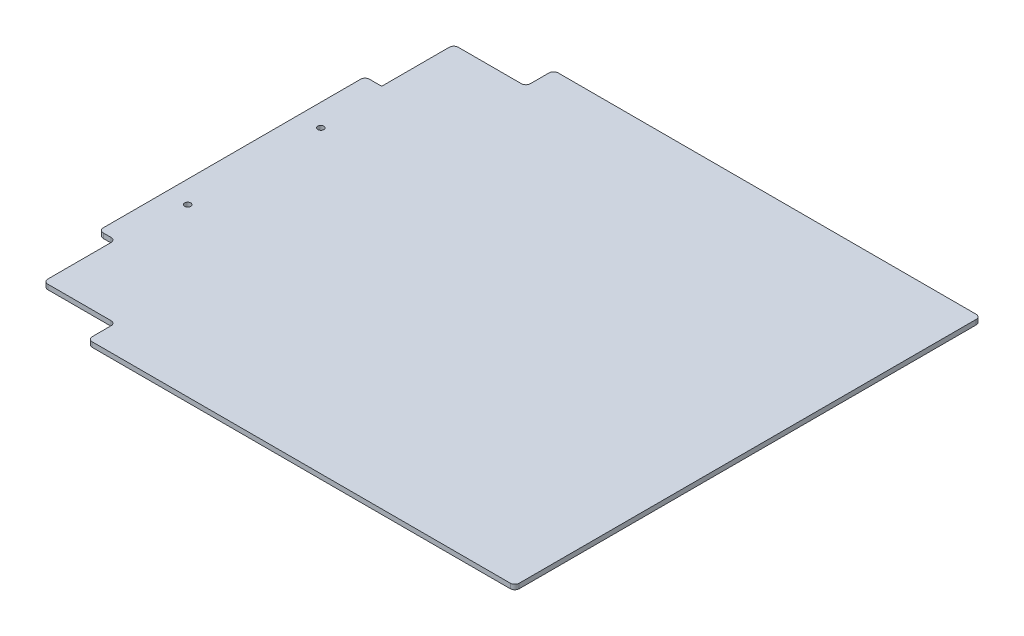
ISO-10303-21;
HEADER;
FILE_DESCRIPTION(('STEP AP214'),'2;1');
FILE_NAME('part.step','',(''),(''),'','','');
FILE_SCHEMA(('AUTOMOTIVE_DESIGN { 1 0 10303 214 1 1 1 1 }'));
ENDSEC;
DATA;
#1=APPLICATION_CONTEXT('core data for automotive mechanical design processes');
#2=APPLICATION_PROTOCOL_DEFINITION('international standard','automotive_design',2000,#1);
#3=PRODUCT_CONTEXT('',#1,'mechanical');
#4=PRODUCT('Part','Part','',(#3));
#5=PRODUCT_RELATED_PRODUCT_CATEGORY('part','',(#4));
#6=PRODUCT_DEFINITION_FORMATION('','',#4);
#7=PRODUCT_DEFINITION_CONTEXT('part definition',#1,'design');
#8=PRODUCT_DEFINITION('design','',#6,#7);
#9=PRODUCT_DEFINITION_SHAPE('','',#8);
#10=(LENGTH_UNIT() NAMED_UNIT(*) SI_UNIT(.MILLI.,.METRE.));
#11=(NAMED_UNIT(*) PLANE_ANGLE_UNIT() SI_UNIT($,.RADIAN.));
#12=(NAMED_UNIT(*) SI_UNIT($,.STERADIAN.) SOLID_ANGLE_UNIT());
#13=UNCERTAINTY_MEASURE_WITH_UNIT(LENGTH_MEASURE(1.E-05),#10,'distance_accuracy_value','');
#14=(GEOMETRIC_REPRESENTATION_CONTEXT(3) GLOBAL_UNCERTAINTY_ASSIGNED_CONTEXT((#13)) GLOBAL_UNIT_ASSIGNED_CONTEXT((#10,
#11,#12)) REPRESENTATION_CONTEXT('',''));
#15=CARTESIAN_POINT('',(0.,0.,0.));
#16=DIRECTION('',(0.,0.,1.));
#17=DIRECTION('',(1.,0.,0.));
#18=AXIS2_PLACEMENT_3D('',#15,#16,#17);
#19=CARTESIAN_POINT('',(0.,2.778125,0.));
#20=DIRECTION('',(1.,0.,0.));
#21=DIRECTION('',(0.,0.,-1.));
#22=AXIS2_PLACEMENT_3D('',#19,#20,#21);
#23=PLANE('',#22);
#24=DIRECTION('',(0.,0.,1.));
#25=VECTOR('',#24,1.);
#26=CARTESIAN_POINT('',(0.,0.,0.));
#27=LINE('',#26,#25);
#28=CARTESIAN_POINT('',(0.,0.,-226.06));
#29=VERTEX_POINT('',#28);
#30=CARTESIAN_POINT('',(0.,0.,-78.74));
#31=VERTEX_POINT('',#30);
#32=EDGE_CURVE('E257',#29,#31,#27,.T.);
#33=ORIENTED_EDGE('',*,*,#32,.T.);
#34=DIRECTION('',(0.,1.,0.));
#35=VECTOR('',#34,1.);
#36=CARTESIAN_POINT('',(0.,2.778125,-78.74));
#37=LINE('',#36,#35);
#38=CARTESIAN_POINT('',(0.,2.778125,-78.74));
#39=VERTEX_POINT('',#38);
#40=EDGE_CURVE('E338',#31,#39,#37,.T.);
#41=ORIENTED_EDGE('',*,*,#40,.T.);
#42=DIRECTION('',(0.,0.,1.));
#43=VECTOR('',#42,1.);
#44=CARTESIAN_POINT('',(0.,2.778125,0.));
#45=LINE('',#44,#43);
#46=CARTESIAN_POINT('',(0.,2.778125,-226.06));
#47=VERTEX_POINT('',#46);
#48=EDGE_CURVE('E265',#47,#39,#45,.T.);
#49=ORIENTED_EDGE('',*,*,#48,.F.);
#50=DIRECTION('',(0.,1.,0.));
#51=VECTOR('',#50,1.);
#52=CARTESIAN_POINT('',(0.,2.778125,-226.06));
#53=LINE('',#52,#51);
#54=EDGE_CURVE('E336',#47,#29,#53,.F.);
#55=ORIENTED_EDGE('',*,*,#54,.T.);
#56=EDGE_LOOP('',(#33,#41,#49,#55));
#57=FACE_BOUND('',#56,.T.);
#58=ADVANCED_FACE('F33',(#57),#23,.F.);
#59=CARTESIAN_POINT('',(0.,2.778125,0.));
#60=DIRECTION('',(0.,-1.,0.));
#61=DIRECTION('',(0.,0.,-1.));
#62=AXIS2_PLACEMENT_3D('',#59,#60,#61);
#63=PLANE('',#62);
#64=CARTESIAN_POINT('',(12.7,2.778125,-190.5762));
#65=DIRECTION('',(0.,1.,0.));
#66=DIRECTION('',(0.,0.,1.));
#67=AXIS2_PLACEMENT_3D('',#64,#65,#66);
#68=CIRCLE('',#67,1.7526);
#69=CARTESIAN_POINT('',(12.7,2.778125,-188.8236));
#70=VERTEX_POINT('',#69);
#71=EDGE_CURVE('E383',#70,#70,#68,.T.);
#72=ORIENTED_EDGE('',*,*,#71,.F.);
#73=EDGE_LOOP('',(#72));
#74=FACE_BOUND('',#73,.T.);
#75=CARTESIAN_POINT('',(12.7,2.778125,-114.3762));
#76=DIRECTION('',(0.,1.,0.));
#77=DIRECTION('',(0.,0.,1.));
#78=AXIS2_PLACEMENT_3D('',#75,#76,#77);
#79=CIRCLE('',#78,1.7526);
#80=CARTESIAN_POINT('',(12.7,2.778125,-112.6236));
#81=VERTEX_POINT('',#80);
#82=EDGE_CURVE('E376',#81,#81,#79,.T.);
#83=ORIENTED_EDGE('',*,*,#82,.F.);
#84=EDGE_LOOP('',(#83));
#85=FACE_BOUND('',#84,.T.);
#86=DIRECTION('',(0.,0.,1.));
#87=VECTOR('',#86,1.);
#88=CARTESIAN_POINT('',(295.275,2.778125,-285.75));
#89=LINE('',#88,#87);
#90=CARTESIAN_POINT('',(295.275,2.778125,-283.21));
#91=VERTEX_POINT('',#90);
#92=CARTESIAN_POINT('',(295.275,2.778125,-21.59));
#93=VERTEX_POINT('',#92);
#94=EDGE_CURVE('E388',#91,#93,#89,.T.);
#95=ORIENTED_EDGE('',*,*,#94,.F.);
#96=CARTESIAN_POINT('',(292.735,2.778125,-283.21));
#97=DIRECTION('',(0.,-1.,0.));
#98=DIRECTION('',(0.,0.,-1.));
#99=AXIS2_PLACEMENT_3D('',#96,#97,#98);
#100=CIRCLE('',#99,2.54);
#101=CARTESIAN_POINT('',(292.735,2.778125,-285.75));
#102=VERTEX_POINT('',#101);
#103=EDGE_CURVE('E289',#91,#102,#100,.F.);
#104=ORIENTED_EDGE('',*,*,#103,.T.);
#105=DIRECTION('',(1.,0.,0.));
#106=VECTOR('',#105,1.);
#107=CARTESIAN_POINT('',(0.,2.778125,-285.75));
#108=LINE('',#107,#106);
#109=CARTESIAN_POINT('',(53.34,2.778125,-285.75));
#110=VERTEX_POINT('',#109);
#111=EDGE_CURVE('E211',#110,#102,#108,.T.);
#112=ORIENTED_EDGE('',*,*,#111,.F.);
#113=CARTESIAN_POINT('',(53.34,2.778125,-283.21));
#114=DIRECTION('',(0.,-1.,0.));
#115=DIRECTION('',(0.,0.,-1.));
#116=AXIS2_PLACEMENT_3D('',#113,#114,#115);
#117=CIRCLE('',#116,2.54);
#118=CARTESIAN_POINT('',(50.8,2.778125,-283.21));
#119=VERTEX_POINT('',#118);
#120=EDGE_CURVE('E277',#110,#119,#117,.F.);
#121=ORIENTED_EDGE('',*,*,#120,.T.);
#122=DIRECTION('',(0.,0.,-1.));
#123=VECTOR('',#122,1.);
#124=CARTESIAN_POINT('',(50.8,2.778125,-285.75));
#125=LINE('',#124,#123);
#126=CARTESIAN_POINT('',(50.8,2.778125,-272.415));
#127=VERTEX_POINT('',#126);
#128=EDGE_CURVE('E221',#127,#119,#125,.T.);
#129=ORIENTED_EDGE('',*,*,#128,.F.);
#130=CARTESIAN_POINT('',(48.26,2.778125,-272.415));
#131=DIRECTION('',(0.,-1.,0.));
#132=DIRECTION('',(0.,0.,-1.));
#133=AXIS2_PLACEMENT_3D('',#130,#131,#132);
#134=CIRCLE('',#133,2.54);
#135=CARTESIAN_POINT('',(48.26,2.778125,-269.875));
#136=VERTEX_POINT('',#135);
#137=EDGE_CURVE('E41',#127,#136,#134,.T.);
#138=ORIENTED_EDGE('',*,*,#137,.T.);
#139=DIRECTION('',(1.,0.,0.));
#140=VECTOR('',#139,1.);
#141=CARTESIAN_POINT('',(50.8,2.778125,-269.875));
#142=LINE('',#141,#140);
#143=CARTESIAN_POINT('',(12.065,2.778125,-269.875));
#144=VERTEX_POINT('',#143);
#145=EDGE_CURVE('E227',#144,#136,#142,.T.);
#146=ORIENTED_EDGE('',*,*,#145,.F.);
#147=CARTESIAN_POINT('',(12.065,2.778125,-267.335));
#148=DIRECTION('',(0.,-1.,0.));
#149=DIRECTION('',(0.,0.,-1.));
#150=AXIS2_PLACEMENT_3D('',#147,#148,#149);
#151=CIRCLE('',#150,2.54);
#152=CARTESIAN_POINT('',(9.52500000000001,2.778125,-267.335));
#153=VERTEX_POINT('',#152);
#154=EDGE_CURVE('E275',#144,#153,#151,.F.);
#155=ORIENTED_EDGE('',*,*,#154,.T.);
#156=DIRECTION('',(0.,0.,-1.));
#157=VECTOR('',#156,1.);
#158=CARTESIAN_POINT('',(9.52500000000001,2.778125,-269.875));
#159=LINE('',#158,#157);
#160=CARTESIAN_POINT('',(9.52500000000001,2.778125,-228.6));
#161=VERTEX_POINT('',#160);
#162=EDGE_CURVE('E225',#161,#153,#159,.T.);
#163=ORIENTED_EDGE('',*,*,#162,.F.);
#164=DIRECTION('',(1.,0.,0.));
#165=VECTOR('',#164,1.);
#166=CARTESIAN_POINT('',(0.,2.778125,-228.6));
#167=LINE('',#166,#165);
#168=CARTESIAN_POINT('',(2.54,2.778125,-228.6));
#169=VERTEX_POINT('',#168);
#170=EDGE_CURVE('E207',#169,#161,#167,.T.);
#171=ORIENTED_EDGE('',*,*,#170,.F.);
#172=CARTESIAN_POINT('',(2.54,2.778125,-226.06));
#173=DIRECTION('',(0.,-1.,0.));
#174=DIRECTION('',(0.,0.,-1.));
#175=AXIS2_PLACEMENT_3D('',#172,#173,#174);
#176=CIRCLE('',#175,2.54);
#177=EDGE_CURVE('E279',#169,#47,#176,.F.);
#178=ORIENTED_EDGE('',*,*,#177,.T.);
#179=ORIENTED_EDGE('',*,*,#48,.T.);
#180=CARTESIAN_POINT('',(2.54,2.778125,-78.74));
#181=DIRECTION('',(0.,-1.,0.));
#182=DIRECTION('',(0.,0.,-1.));
#183=AXIS2_PLACEMENT_3D('',#180,#181,#182);
#184=CIRCLE('',#183,2.54);
#185=CARTESIAN_POINT('',(2.54,2.778125,-76.2));
#186=VERTEX_POINT('',#185);
#187=EDGE_CURVE('E281',#39,#186,#184,.F.);
#188=ORIENTED_EDGE('',*,*,#187,.T.);
#189=DIRECTION('',(-1.,0.,0.));
#190=VECTOR('',#189,1.);
#191=CARTESIAN_POINT('',(0.,2.778125,-76.2));
#192=LINE('',#191,#190);
#193=CARTESIAN_POINT('',(6.985,2.778125,-76.2));
#194=VERTEX_POINT('',#193);
#195=EDGE_CURVE('E234',#194,#186,#192,.T.);
#196=ORIENTED_EDGE('',*,*,#195,.F.);
#197=CARTESIAN_POINT('',(6.985,2.778125,-73.66));
#198=DIRECTION('',(0.,-1.,0.));
#199=DIRECTION('',(0.,0.,-1.));
#200=AXIS2_PLACEMENT_3D('',#197,#198,#199);
#201=CIRCLE('',#200,2.54);
#202=CARTESIAN_POINT('',(9.525,2.778125,-73.66));
#203=VERTEX_POINT('',#202);
#204=EDGE_CURVE('E357',#194,#203,#201,.T.);
#205=ORIENTED_EDGE('',*,*,#204,.T.);
#206=DIRECTION('',(0.,0.,-1.));
#207=VECTOR('',#206,1.);
#208=CARTESIAN_POINT('',(9.525,2.778125,-76.2));
#209=LINE('',#208,#207);
#210=CARTESIAN_POINT('',(9.52500000000001,2.778125,-37.465));
#211=VERTEX_POINT('',#210);
#212=EDGE_CURVE('E249',#211,#203,#209,.T.);
#213=ORIENTED_EDGE('',*,*,#212,.F.);
#214=CARTESIAN_POINT('',(12.065,2.778125,-37.465));
#215=DIRECTION('',(0.,-1.,0.));
#216=DIRECTION('',(0.,0.,-1.));
#217=AXIS2_PLACEMENT_3D('',#214,#215,#216);
#218=CIRCLE('',#217,2.54);
#219=CARTESIAN_POINT('',(12.065,2.778125,-34.925));
#220=VERTEX_POINT('',#219);
#221=EDGE_CURVE('E283',#211,#220,#218,.F.);
#222=ORIENTED_EDGE('',*,*,#221,.T.);
#223=DIRECTION('',(-1.,0.,0.));
#224=VECTOR('',#223,1.);
#225=CARTESIAN_POINT('',(9.52500000000001,2.778125,-34.925));
#226=LINE('',#225,#224);
#227=CARTESIAN_POINT('',(48.26,2.778125,-34.925));
#228=VERTEX_POINT('',#227);
#229=EDGE_CURVE('E245',#228,#220,#226,.T.);
#230=ORIENTED_EDGE('',*,*,#229,.F.);
#231=CARTESIAN_POINT('',(48.26,2.778125,-32.385));
#232=DIRECTION('',(0.,-1.,0.));
#233=DIRECTION('',(0.,0.,-1.));
#234=AXIS2_PLACEMENT_3D('',#231,#232,#233);
#235=CIRCLE('',#234,2.54);
#236=CARTESIAN_POINT('',(50.8,2.778125,-32.385));
#237=VERTEX_POINT('',#236);
#238=EDGE_CURVE('E353',#228,#237,#235,.T.);
#239=ORIENTED_EDGE('',*,*,#238,.T.);
#240=DIRECTION('',(0.,0.,-1.));
#241=VECTOR('',#240,1.);
#242=CARTESIAN_POINT('',(50.8,2.778125,-34.925));
#243=LINE('',#242,#241);
#244=CARTESIAN_POINT('',(50.8,2.778125,-21.59));
#245=VERTEX_POINT('',#244);
#246=EDGE_CURVE('E242',#245,#237,#243,.T.);
#247=ORIENTED_EDGE('',*,*,#246,.F.);
#248=CARTESIAN_POINT('',(53.34,2.778125,-21.59));
#249=DIRECTION('',(0.,-1.,0.));
#250=DIRECTION('',(0.,0.,-1.));
#251=AXIS2_PLACEMENT_3D('',#248,#249,#250);
#252=CIRCLE('',#251,2.54);
#253=CARTESIAN_POINT('',(53.34,2.778125,-19.05));
#254=VERTEX_POINT('',#253);
#255=EDGE_CURVE('E285',#245,#254,#252,.F.);
#256=ORIENTED_EDGE('',*,*,#255,.T.);
#257=DIRECTION('',(-1.,0.,0.));
#258=VECTOR('',#257,1.);
#259=CARTESIAN_POINT('',(0.,2.778125,-19.05));
#260=LINE('',#259,#258);
#261=CARTESIAN_POINT('',(292.735,2.778125,-19.05));
#262=VERTEX_POINT('',#261);
#263=EDGE_CURVE('E258',#262,#254,#260,.T.);
#264=ORIENTED_EDGE('',*,*,#263,.F.);
#265=CARTESIAN_POINT('',(292.735,2.778125,-21.59));
#266=DIRECTION('',(0.,-1.,0.));
#267=DIRECTION('',(0.,0.,-1.));
#268=AXIS2_PLACEMENT_3D('',#265,#266,#267);
#269=CIRCLE('',#268,2.54);
#270=EDGE_CURVE('E287',#262,#93,#269,.F.);
#271=ORIENTED_EDGE('',*,*,#270,.T.);
#272=EDGE_LOOP('',(#95,#104,#112,#121,#129,#138,#146,#155,#163,#171,#178,#179,#188,#196,#205,
#213,#222,#230,#239,#247,#256,#264,#271));
#273=FACE_BOUND('',#272,.T.);
#274=ADVANCED_FACE('F364',(#74,#85,#273),#63,.F.);
#275=CARTESIAN_POINT('',(0.,0.,0.));
#276=DIRECTION('',(0.,-1.,0.));
#277=DIRECTION('',(0.,0.,-1.));
#278=AXIS2_PLACEMENT_3D('',#275,#276,#277);
#279=PLANE('',#278);
#280=DIRECTION('',(1.,0.,0.));
#281=VECTOR('',#280,1.);
#282=CARTESIAN_POINT('',(0.,0.,-285.75));
#283=LINE('',#282,#281);
#284=CARTESIAN_POINT('',(53.34,0.,-285.75));
#285=VERTEX_POINT('',#284);
#286=CARTESIAN_POINT('',(292.735,0.,-285.75));
#287=VERTEX_POINT('',#286);
#288=EDGE_CURVE('E261',#285,#287,#283,.T.);
#289=ORIENTED_EDGE('',*,*,#288,.T.);
#290=CARTESIAN_POINT('',(292.735,0.,-283.21));
#291=DIRECTION('',(0.,-1.,0.));
#292=DIRECTION('',(0.,0.,-1.));
#293=AXIS2_PLACEMENT_3D('',#290,#291,#292);
#294=CIRCLE('',#293,2.54);
#295=CARTESIAN_POINT('',(295.275,0.,-283.21));
#296=VERTEX_POINT('',#295);
#297=EDGE_CURVE('E309',#287,#296,#294,.T.);
#298=ORIENTED_EDGE('',*,*,#297,.T.);
#299=DIRECTION('',(0.,0.,1.));
#300=VECTOR('',#299,1.);
#301=CARTESIAN_POINT('',(295.275,0.,-285.75));
#302=LINE('',#301,#300);
#303=CARTESIAN_POINT('',(295.275,0.,-21.59));
#304=VERTEX_POINT('',#303);
#305=EDGE_CURVE('E380',#296,#304,#302,.T.);
#306=ORIENTED_EDGE('',*,*,#305,.T.);
#307=CARTESIAN_POINT('',(292.735,0.,-21.59));
#308=DIRECTION('',(0.,-1.,0.));
#309=DIRECTION('',(0.,0.,-1.));
#310=AXIS2_PLACEMENT_3D('',#307,#308,#309);
#311=CIRCLE('',#310,2.54);
#312=CARTESIAN_POINT('',(292.735,0.,-19.05));
#313=VERTEX_POINT('',#312);
#314=EDGE_CURVE('E307',#304,#313,#311,.T.);
#315=ORIENTED_EDGE('',*,*,#314,.T.);
#316=DIRECTION('',(-1.,0.,0.));
#317=VECTOR('',#316,1.);
#318=CARTESIAN_POINT('',(0.,0.,-19.05));
#319=LINE('',#318,#317);
#320=CARTESIAN_POINT('',(53.34,0.,-19.05));
#321=VERTEX_POINT('',#320);
#322=EDGE_CURVE('E254',#313,#321,#319,.T.);
#323=ORIENTED_EDGE('',*,*,#322,.T.);
#324=CARTESIAN_POINT('',(53.34,0.,-21.59));
#325=DIRECTION('',(0.,-1.,0.));
#326=DIRECTION('',(0.,0.,-1.));
#327=AXIS2_PLACEMENT_3D('',#324,#325,#326);
#328=CIRCLE('',#327,2.54);
#329=CARTESIAN_POINT('',(50.8,0.,-21.59));
#330=VERTEX_POINT('',#329);
#331=EDGE_CURVE('E305',#321,#330,#328,.T.);
#332=ORIENTED_EDGE('',*,*,#331,.T.);
#333=DIRECTION('',(0.,0.,-1.));
#334=VECTOR('',#333,1.);
#335=CARTESIAN_POINT('',(50.8,0.,-34.925));
#336=LINE('',#335,#334);
#337=CARTESIAN_POINT('',(50.8,0.,-32.385));
#338=VERTEX_POINT('',#337);
#339=EDGE_CURVE('E230',#330,#338,#336,.T.);
#340=ORIENTED_EDGE('',*,*,#339,.T.);
#341=CARTESIAN_POINT('',(48.26,0.,-32.385));
#342=DIRECTION('',(0.,-1.,0.));
#343=DIRECTION('',(0.,0.,-1.));
#344=AXIS2_PLACEMENT_3D('',#341,#342,#343);
#345=CIRCLE('',#344,2.54);
#346=CARTESIAN_POINT('',(48.26,0.,-34.925));
#347=VERTEX_POINT('',#346);
#348=EDGE_CURVE('E355',#338,#347,#345,.F.);
#349=ORIENTED_EDGE('',*,*,#348,.T.);
#350=DIRECTION('',(-1.,0.,0.));
#351=VECTOR('',#350,1.);
#352=CARTESIAN_POINT('',(9.52500000000001,0.,-34.925));
#353=LINE('',#352,#351);
#354=CARTESIAN_POINT('',(12.065,0.,-34.925));
#355=VERTEX_POINT('',#354);
#356=EDGE_CURVE('E233',#347,#355,#353,.T.);
#357=ORIENTED_EDGE('',*,*,#356,.T.);
#358=CARTESIAN_POINT('',(12.065,0.,-37.465));
#359=DIRECTION('',(0.,-1.,0.));
#360=DIRECTION('',(0.,0.,-1.));
#361=AXIS2_PLACEMENT_3D('',#358,#359,#360);
#362=CIRCLE('',#361,2.54);
#363=CARTESIAN_POINT('',(9.52500000000001,0.,-37.465));
#364=VERTEX_POINT('',#363);
#365=EDGE_CURVE('E303',#355,#364,#362,.T.);
#366=ORIENTED_EDGE('',*,*,#365,.T.);
#367=DIRECTION('',(0.,0.,-1.));
#368=VECTOR('',#367,1.);
#369=CARTESIAN_POINT('',(9.525,0.,-76.2));
#370=LINE('',#369,#368);
#371=CARTESIAN_POINT('',(9.525,0.,-73.66));
#372=VERTEX_POINT('',#371);
#373=EDGE_CURVE('E237',#364,#372,#370,.T.);
#374=ORIENTED_EDGE('',*,*,#373,.T.);
#375=CARTESIAN_POINT('',(6.985,0.,-73.66));
#376=DIRECTION('',(0.,-1.,0.));
#377=DIRECTION('',(0.,0.,-1.));
#378=AXIS2_PLACEMENT_3D('',#375,#376,#377);
#379=CIRCLE('',#378,2.54);
#380=CARTESIAN_POINT('',(6.985,0.,-76.2));
#381=VERTEX_POINT('',#380);
#382=EDGE_CURVE('E359',#372,#381,#379,.F.);
#383=ORIENTED_EDGE('',*,*,#382,.T.);
#384=DIRECTION('',(-1.,0.,0.));
#385=VECTOR('',#384,1.);
#386=CARTESIAN_POINT('',(0.,0.,-76.2));
#387=LINE('',#386,#385);
#388=CARTESIAN_POINT('',(2.54,0.,-76.2));
#389=VERTEX_POINT('',#388);
#390=EDGE_CURVE('E223',#381,#389,#387,.T.);
#391=ORIENTED_EDGE('',*,*,#390,.T.);
#392=CARTESIAN_POINT('',(2.54,0.,-78.74));
#393=DIRECTION('',(0.,-1.,0.));
#394=DIRECTION('',(0.,0.,-1.));
#395=AXIS2_PLACEMENT_3D('',#392,#393,#394);
#396=CIRCLE('',#395,2.54);
#397=EDGE_CURVE('E301',#389,#31,#396,.T.);
#398=ORIENTED_EDGE('',*,*,#397,.T.);
#399=ORIENTED_EDGE('',*,*,#32,.F.);
#400=CARTESIAN_POINT('',(2.54,0.,-226.06));
#401=DIRECTION('',(0.,-1.,0.));
#402=DIRECTION('',(0.,0.,-1.));
#403=AXIS2_PLACEMENT_3D('',#400,#401,#402);
#404=CIRCLE('',#403,2.54);
#405=CARTESIAN_POINT('',(2.54,0.,-228.6));
#406=VERTEX_POINT('',#405);
#407=EDGE_CURVE('E197',#29,#406,#404,.T.);
#408=ORIENTED_EDGE('',*,*,#407,.T.);
#409=DIRECTION('',(1.,0.,0.));
#410=VECTOR('',#409,1.);
#411=CARTESIAN_POINT('',(0.,0.,-228.6));
#412=LINE('',#411,#410);
#413=CARTESIAN_POINT('',(9.52500000000001,0.,-228.6));
#414=VERTEX_POINT('',#413);
#415=EDGE_CURVE('E187',#406,#414,#412,.T.);
#416=ORIENTED_EDGE('',*,*,#415,.T.);
#417=DIRECTION('',(0.,0.,-1.));
#418=VECTOR('',#417,1.);
#419=CARTESIAN_POINT('',(9.52500000000001,0.,-269.875));
#420=LINE('',#419,#418);
#421=CARTESIAN_POINT('',(9.52500000000001,0.,-267.335));
#422=VERTEX_POINT('',#421);
#423=EDGE_CURVE('E193',#414,#422,#420,.T.);
#424=ORIENTED_EDGE('',*,*,#423,.T.);
#425=CARTESIAN_POINT('',(12.065,0.,-267.335));
#426=DIRECTION('',(0.,-1.,0.));
#427=DIRECTION('',(0.,0.,-1.));
#428=AXIS2_PLACEMENT_3D('',#425,#426,#427);
#429=CIRCLE('',#428,2.54);
#430=CARTESIAN_POINT('',(12.065,0.,-269.875));
#431=VERTEX_POINT('',#430);
#432=EDGE_CURVE('E296',#422,#431,#429,.T.);
#433=ORIENTED_EDGE('',*,*,#432,.T.);
#434=DIRECTION('',(1.,0.,0.));
#435=VECTOR('',#434,1.);
#436=CARTESIAN_POINT('',(50.8,0.,-269.875));
#437=LINE('',#436,#435);
#438=CARTESIAN_POINT('',(48.26,0.,-269.875));
#439=VERTEX_POINT('',#438);
#440=EDGE_CURVE('E212',#431,#439,#437,.T.);
#441=ORIENTED_EDGE('',*,*,#440,.T.);
#442=CARTESIAN_POINT('',(48.26,0.,-272.415));
#443=DIRECTION('',(0.,-1.,0.));
#444=DIRECTION('',(0.,0.,-1.));
#445=AXIS2_PLACEMENT_3D('',#442,#443,#444);
#446=CIRCLE('',#445,2.54);
#447=CARTESIAN_POINT('',(50.8,0.,-272.415));
#448=VERTEX_POINT('',#447);
#449=EDGE_CURVE('E11',#439,#448,#446,.F.);
#450=ORIENTED_EDGE('',*,*,#449,.T.);
#451=DIRECTION('',(0.,0.,-1.));
#452=VECTOR('',#451,1.);
#453=CARTESIAN_POINT('',(50.8,0.,-285.75));
#454=LINE('',#453,#452);
#455=CARTESIAN_POINT('',(50.8,0.,-283.21));
#456=VERTEX_POINT('',#455);
#457=EDGE_CURVE('E201',#448,#456,#454,.T.);
#458=ORIENTED_EDGE('',*,*,#457,.T.);
#459=CARTESIAN_POINT('',(53.34,0.,-283.21));
#460=DIRECTION('',(0.,-1.,0.));
#461=DIRECTION('',(0.,0.,-1.));
#462=AXIS2_PLACEMENT_3D('',#459,#460,#461);
#463=CIRCLE('',#462,2.54);
#464=EDGE_CURVE('E298',#456,#285,#463,.T.);
#465=ORIENTED_EDGE('',*,*,#464,.T.);
#466=EDGE_LOOP('',(#289,#298,#306,#315,#323,#332,#340,#349,#357,#366,#374,#383,#391,#398,#399,
#408,#416,#424,#433,#441,#450,#458,#465));
#467=FACE_BOUND('',#466,.T.);
#468=CARTESIAN_POINT('',(12.7,0.,-190.5762));
#469=DIRECTION('',(0.,1.,0.));
#470=DIRECTION('',(0.,0.,1.));
#471=AXIS2_PLACEMENT_3D('',#468,#469,#470);
#472=CIRCLE('',#471,1.7526);
#473=CARTESIAN_POINT('',(12.7,0.,-188.8236));
#474=VERTEX_POINT('',#473);
#475=EDGE_CURVE('E246',#474,#474,#472,.T.);
#476=ORIENTED_EDGE('',*,*,#475,.T.);
#477=EDGE_LOOP('',(#476));
#478=FACE_BOUND('',#477,.T.);
#479=CARTESIAN_POINT('',(12.7,0.,-114.3762));
#480=DIRECTION('',(0.,1.,0.));
#481=DIRECTION('',(0.,0.,1.));
#482=AXIS2_PLACEMENT_3D('',#479,#480,#481);
#483=CIRCLE('',#482,1.7526);
#484=CARTESIAN_POINT('',(12.7,0.,-112.6236));
#485=VERTEX_POINT('',#484);
#486=EDGE_CURVE('E379',#485,#485,#483,.T.);
#487=ORIENTED_EDGE('',*,*,#486,.T.);
#488=EDGE_LOOP('',(#487));
#489=FACE_BOUND('',#488,.T.);
#490=ADVANCED_FACE('F190',(#467,#478,#489),#279,.T.);
#491=CARTESIAN_POINT('',(0.,0.,-285.75));
#492=DIRECTION('',(0.,0.,1.));
#493=DIRECTION('',(1.,0.,0.));
#494=AXIS2_PLACEMENT_3D('',#491,#492,#493);
#495=PLANE('',#494);
#496=ORIENTED_EDGE('',*,*,#111,.T.);
#497=DIRECTION('',(0.,1.,0.));
#498=VECTOR('',#497,1.);
#499=CARTESIAN_POINT('',(292.735,0.,-285.75));
#500=LINE('',#499,#498);
#501=EDGE_CURVE('E294',#102,#287,#500,.F.);
#502=ORIENTED_EDGE('',*,*,#501,.T.);
#503=ORIENTED_EDGE('',*,*,#288,.F.);
#504=DIRECTION('',(0.,1.,0.));
#505=VECTOR('',#504,1.);
#506=CARTESIAN_POINT('',(53.34,0.,-285.75));
#507=LINE('',#506,#505);
#508=EDGE_CURVE('E291',#285,#110,#507,.T.);
#509=ORIENTED_EDGE('',*,*,#508,.T.);
#510=EDGE_LOOP('',(#496,#502,#503,#509));
#511=FACE_BOUND('',#510,.T.);
#512=ADVANCED_FACE('F493',(#511),#495,.F.);
#513=CARTESIAN_POINT('',(0.,0.,-19.05));
#514=DIRECTION('',(0.,0.,-1.));
#515=DIRECTION('',(-1.,0.,0.));
#516=AXIS2_PLACEMENT_3D('',#513,#514,#515);
#517=PLANE('',#516);
#518=ORIENTED_EDGE('',*,*,#322,.F.);
#519=DIRECTION('',(0.,1.,0.));
#520=VECTOR('',#519,1.);
#521=CARTESIAN_POINT('',(292.735,0.,-19.05));
#522=LINE('',#521,#520);
#523=EDGE_CURVE('E313',#313,#262,#522,.T.);
#524=ORIENTED_EDGE('',*,*,#523,.T.);
#525=ORIENTED_EDGE('',*,*,#263,.T.);
#526=DIRECTION('',(0.,1.,0.));
#527=VECTOR('',#526,1.);
#528=CARTESIAN_POINT('',(53.34,0.,-19.05));
#529=LINE('',#528,#527);
#530=EDGE_CURVE('E311',#254,#321,#529,.F.);
#531=ORIENTED_EDGE('',*,*,#530,.T.);
#532=EDGE_LOOP('',(#518,#524,#525,#531));
#533=FACE_BOUND('',#532,.T.);
#534=ADVANCED_FACE('F404',(#533),#517,.F.);
#535=CARTESIAN_POINT('',(0.,0.,-76.2));
#536=DIRECTION('',(0.,0.,-1.));
#537=DIRECTION('',(-1.,0.,0.));
#538=AXIS2_PLACEMENT_3D('',#535,#536,#537);
#539=PLANE('',#538);
#540=ORIENTED_EDGE('',*,*,#390,.F.);
#541=DIRECTION('',(0.,1.,0.));
#542=VECTOR('',#541,1.);
#543=CARTESIAN_POINT('',(6.985,2.778125,-76.2));
#544=LINE('',#543,#542);
#545=EDGE_CURVE('E328',#381,#194,#544,.T.);
#546=ORIENTED_EDGE('',*,*,#545,.T.);
#547=ORIENTED_EDGE('',*,*,#195,.T.);
#548=DIRECTION('',(0.,1.,0.));
#549=VECTOR('',#548,1.);
#550=CARTESIAN_POINT('',(2.54,0.,-76.2));
#551=LINE('',#550,#549);
#552=EDGE_CURVE('E326',#186,#389,#551,.F.);
#553=ORIENTED_EDGE('',*,*,#552,.T.);
#554=EDGE_LOOP('',(#540,#546,#547,#553));
#555=FACE_BOUND('',#554,.T.);
#556=ADVANCED_FACE('F440',(#555),#539,.F.);
#557=CARTESIAN_POINT('',(9.525,0.,-76.2));
#558=DIRECTION('',(1.,0.,0.));
#559=DIRECTION('',(0.,0.,-1.));
#560=AXIS2_PLACEMENT_3D('',#557,#558,#559);
#561=PLANE('',#560);
#562=ORIENTED_EDGE('',*,*,#212,.T.);
#563=DIRECTION('',(0.,1.,0.));
#564=VECTOR('',#563,1.);
#565=CARTESIAN_POINT('',(9.525,0.,-73.66));
#566=LINE('',#565,#564);
#567=EDGE_CURVE('E334',#203,#372,#566,.F.);
#568=ORIENTED_EDGE('',*,*,#567,.T.);
#569=ORIENTED_EDGE('',*,*,#373,.F.);
#570=DIRECTION('',(0.,1.,0.));
#571=VECTOR('',#570,1.);
#572=CARTESIAN_POINT('',(9.52500000000001,0.,-37.465));
#573=LINE('',#572,#571);
#574=EDGE_CURVE('E331',#364,#211,#573,.T.);
#575=ORIENTED_EDGE('',*,*,#574,.T.);
#576=EDGE_LOOP('',(#562,#568,#569,#575));
#577=FACE_BOUND('',#576,.T.);
#578=ADVANCED_FACE('F431',(#577),#561,.F.);
#579=CARTESIAN_POINT('',(9.52500000000001,0.,-34.925));
#580=DIRECTION('',(0.,0.,-1.));
#581=DIRECTION('',(-1.,0.,0.));
#582=AXIS2_PLACEMENT_3D('',#579,#580,#581);
#583=PLANE('',#582);
#584=ORIENTED_EDGE('',*,*,#356,.F.);
#585=DIRECTION('',(0.,1.,0.));
#586=VECTOR('',#585,1.);
#587=CARTESIAN_POINT('',(48.26,2.778125,-34.925));
#588=LINE('',#587,#586);
#589=EDGE_CURVE('E323',#347,#228,#588,.T.);
#590=ORIENTED_EDGE('',*,*,#589,.T.);
#591=ORIENTED_EDGE('',*,*,#229,.T.);
#592=DIRECTION('',(0.,1.,0.));
#593=VECTOR('',#592,1.);
#594=CARTESIAN_POINT('',(12.065,0.,-34.925));
#595=LINE('',#594,#593);
#596=EDGE_CURVE('E321',#220,#355,#595,.F.);
#597=ORIENTED_EDGE('',*,*,#596,.T.);
#598=EDGE_LOOP('',(#584,#590,#591,#597));
#599=FACE_BOUND('',#598,.T.);
#600=ADVANCED_FACE('F422',(#599),#583,.F.);
#601=CARTESIAN_POINT('',(50.8,0.,-34.925));
#602=DIRECTION('',(1.,0.,0.));
#603=DIRECTION('',(0.,0.,-1.));
#604=AXIS2_PLACEMENT_3D('',#601,#602,#603);
#605=PLANE('',#604);
#606=ORIENTED_EDGE('',*,*,#339,.F.);
#607=DIRECTION('',(0.,1.,0.));
#608=VECTOR('',#607,1.);
#609=CARTESIAN_POINT('',(50.8,0.,-21.59));
#610=LINE('',#609,#608);
#611=EDGE_CURVE('E318',#330,#245,#610,.T.);
#612=ORIENTED_EDGE('',*,*,#611,.T.);
#613=ORIENTED_EDGE('',*,*,#246,.T.);
#614=DIRECTION('',(0.,1.,0.));
#615=VECTOR('',#614,1.);
#616=CARTESIAN_POINT('',(50.8,0.,-32.385));
#617=LINE('',#616,#615);
#618=EDGE_CURVE('E316',#237,#338,#617,.F.);
#619=ORIENTED_EDGE('',*,*,#618,.T.);
#620=EDGE_LOOP('',(#606,#612,#613,#619));
#621=FACE_BOUND('',#620,.T.);
#622=ADVANCED_FACE('F413',(#621),#605,.F.);
#623=CARTESIAN_POINT('',(50.8,0.,-285.75));
#624=DIRECTION('',(1.,0.,0.));
#625=DIRECTION('',(0.,0.,-1.));
#626=AXIS2_PLACEMENT_3D('',#623,#624,#625);
#627=PLANE('',#626);
#628=ORIENTED_EDGE('',*,*,#128,.T.);
#629=DIRECTION('',(0.,1.,0.));
#630=VECTOR('',#629,1.);
#631=CARTESIAN_POINT('',(50.8,0.,-283.21));
#632=LINE('',#631,#630);
#633=EDGE_CURVE('E48',#119,#456,#632,.F.);
#634=ORIENTED_EDGE('',*,*,#633,.T.);
#635=ORIENTED_EDGE('',*,*,#457,.F.);
#636=DIRECTION('',(0.,1.,0.));
#637=VECTOR('',#636,1.);
#638=CARTESIAN_POINT('',(50.8,2.778125,-272.415));
#639=LINE('',#638,#637);
#640=EDGE_CURVE('E343',#448,#127,#639,.T.);
#641=ORIENTED_EDGE('',*,*,#640,.T.);
#642=EDGE_LOOP('',(#628,#634,#635,#641));
#643=FACE_BOUND('',#642,.T.);
#644=ADVANCED_FACE('F373',(#643),#627,.F.);
#645=CARTESIAN_POINT('',(50.8,0.,-269.875));
#646=DIRECTION('',(0.,0.,1.));
#647=DIRECTION('',(1.,0.,0.));
#648=AXIS2_PLACEMENT_3D('',#645,#646,#647);
#649=PLANE('',#648);
#650=ORIENTED_EDGE('',*,*,#145,.T.);
#651=DIRECTION('',(0.,1.,0.));
#652=VECTOR('',#651,1.);
#653=CARTESIAN_POINT('',(48.26,0.,-269.875));
#654=LINE('',#653,#652);
#655=EDGE_CURVE('E350',#136,#439,#654,.F.);
#656=ORIENTED_EDGE('',*,*,#655,.T.);
#657=ORIENTED_EDGE('',*,*,#440,.F.);
#658=DIRECTION('',(0.,1.,0.));
#659=VECTOR('',#658,1.);
#660=CARTESIAN_POINT('',(12.065,0.,-269.875));
#661=LINE('',#660,#659);
#662=EDGE_CURVE('E347',#431,#144,#661,.T.);
#663=ORIENTED_EDGE('',*,*,#662,.T.);
#664=EDGE_LOOP('',(#650,#656,#657,#663));
#665=FACE_BOUND('',#664,.T.);
#666=ADVANCED_FACE('F369',(#665),#649,.F.);
#667=CARTESIAN_POINT('',(9.52500000000001,0.,-269.875));
#668=DIRECTION('',(1.,0.,0.));
#669=DIRECTION('',(0.,0.,-1.));
#670=AXIS2_PLACEMENT_3D('',#667,#668,#669);
#671=PLANE('',#670);
#672=ORIENTED_EDGE('',*,*,#162,.T.);
#673=DIRECTION('',(0.,1.,0.));
#674=VECTOR('',#673,1.);
#675=CARTESIAN_POINT('',(9.52500000000001,0.,-267.335));
#676=LINE('',#675,#674);
#677=EDGE_CURVE('E216',#153,#422,#676,.F.);
#678=ORIENTED_EDGE('',*,*,#677,.T.);
#679=ORIENTED_EDGE('',*,*,#423,.F.);
#680=DIRECTION('',(0.,1.,0.));
#681=VECTOR('',#680,1.);
#682=CARTESIAN_POINT('',(9.52500000000001,0.,-228.6));
#683=LINE('',#682,#681);
#684=EDGE_CURVE('E204',#414,#161,#683,.T.);
#685=ORIENTED_EDGE('',*,*,#684,.T.);
#686=EDGE_LOOP('',(#672,#678,#679,#685));
#687=FACE_BOUND('',#686,.T.);
#688=ADVANCED_FACE('F214',(#687),#671,.F.);
#689=CARTESIAN_POINT('',(0.,0.,-228.6));
#690=DIRECTION('',(0.,0.,1.));
#691=DIRECTION('',(1.,0.,0.));
#692=AXIS2_PLACEMENT_3D('',#689,#690,#691);
#693=PLANE('',#692);
#694=ORIENTED_EDGE('',*,*,#415,.F.);
#695=DIRECTION('',(0.,1.,0.));
#696=VECTOR('',#695,1.);
#697=CARTESIAN_POINT('',(2.54,0.,-228.6));
#698=LINE('',#697,#696);
#699=EDGE_CURVE('E341',#406,#169,#698,.T.);
#700=ORIENTED_EDGE('',*,*,#699,.T.);
#701=ORIENTED_EDGE('',*,*,#170,.T.);
#702=ORIENTED_EDGE('',*,*,#684,.F.);
#703=EDGE_LOOP('',(#694,#700,#701,#702));
#704=FACE_BOUND('',#703,.T.);
#705=ADVANCED_FACE('F205',(#704),#693,.F.);
#706=CARTESIAN_POINT('',(12.7,0.,-114.3762));
#707=DIRECTION('',(0.,1.,0.));
#708=DIRECTION('',(0.,0.,1.));
#709=AXIS2_PLACEMENT_3D('',#706,#707,#708);
#710=CYLINDRICAL_SURFACE('',#709,1.7526);
#711=ORIENTED_EDGE('',*,*,#486,.F.);
#712=EDGE_LOOP('',(#711));
#713=FACE_BOUND('',#712,.T.);
#714=ORIENTED_EDGE('',*,*,#82,.T.);
#715=EDGE_LOOP('',(#714));
#716=FACE_BOUND('',#715,.T.);
#717=ADVANCED_FACE('F504',(#713,#716),#710,.F.);
#718=CARTESIAN_POINT('',(12.7,0.,-190.5762));
#719=DIRECTION('',(0.,1.,0.));
#720=DIRECTION('',(0.,0.,1.));
#721=AXIS2_PLACEMENT_3D('',#718,#719,#720);
#722=CYLINDRICAL_SURFACE('',#721,1.7526);
#723=ORIENTED_EDGE('',*,*,#475,.F.);
#724=EDGE_LOOP('',(#723));
#725=FACE_BOUND('',#724,.T.);
#726=ORIENTED_EDGE('',*,*,#71,.T.);
#727=EDGE_LOOP('',(#726));
#728=FACE_BOUND('',#727,.T.);
#729=ADVANCED_FACE('F497',(#725,#728),#722,.F.);
#730=CARTESIAN_POINT('',(295.275,0.,-285.75));
#731=DIRECTION('',(-1.,0.,0.));
#732=DIRECTION('',(0.,0.,1.));
#733=AXIS2_PLACEMENT_3D('',#730,#731,#732);
#734=PLANE('',#733);
#735=ORIENTED_EDGE('',*,*,#305,.F.);
#736=DIRECTION('',(0.,1.,0.));
#737=VECTOR('',#736,1.);
#738=CARTESIAN_POINT('',(295.275,0.,-283.21));
#739=LINE('',#738,#737);
#740=EDGE_CURVE('E272',#296,#91,#739,.T.);
#741=ORIENTED_EDGE('',*,*,#740,.T.);
#742=ORIENTED_EDGE('',*,*,#94,.T.);
#743=DIRECTION('',(0.,1.,0.));
#744=VECTOR('',#743,1.);
#745=CARTESIAN_POINT('',(295.275,0.,-21.59));
#746=LINE('',#745,#744);
#747=EDGE_CURVE('E268',#93,#304,#746,.F.);
#748=ORIENTED_EDGE('',*,*,#747,.T.);
#749=EDGE_LOOP('',(#735,#741,#742,#748));
#750=FACE_BOUND('',#749,.T.);
#751=ADVANCED_FACE('F470',(#750),#734,.F.);
#752=CARTESIAN_POINT('',(292.735,0.,-283.21));
#753=DIRECTION('',(0.,1.,0.));
#754=DIRECTION('',(0.,0.,1.));
#755=AXIS2_PLACEMENT_3D('',#752,#753,#754);
#756=CYLINDRICAL_SURFACE('',#755,2.54);
#757=ORIENTED_EDGE('',*,*,#297,.F.);
#758=ORIENTED_EDGE('',*,*,#501,.F.);
#759=ORIENTED_EDGE('',*,*,#103,.F.);
#760=ORIENTED_EDGE('',*,*,#740,.F.);
#761=EDGE_LOOP('',(#757,#758,#759,#760));
#762=FACE_BOUND('',#761,.T.);
#763=ADVANCED_FACE('F467',(#762),#756,.T.);
#764=CARTESIAN_POINT('',(292.735,0.,-21.59));
#765=DIRECTION('',(0.,1.,0.));
#766=DIRECTION('',(0.,0.,1.));
#767=AXIS2_PLACEMENT_3D('',#764,#765,#766);
#768=CYLINDRICAL_SURFACE('',#767,2.54);
#769=ORIENTED_EDGE('',*,*,#314,.F.);
#770=ORIENTED_EDGE('',*,*,#747,.F.);
#771=ORIENTED_EDGE('',*,*,#270,.F.);
#772=ORIENTED_EDGE('',*,*,#523,.F.);
#773=EDGE_LOOP('',(#769,#770,#771,#772));
#774=FACE_BOUND('',#773,.T.);
#775=ADVANCED_FACE('F401',(#774),#768,.T.);
#776=CARTESIAN_POINT('',(53.34,0.,-21.59));
#777=DIRECTION('',(0.,1.,0.));
#778=DIRECTION('',(0.,0.,1.));
#779=AXIS2_PLACEMENT_3D('',#776,#777,#778);
#780=CYLINDRICAL_SURFACE('',#779,2.54);
#781=ORIENTED_EDGE('',*,*,#331,.F.);
#782=ORIENTED_EDGE('',*,*,#530,.F.);
#783=ORIENTED_EDGE('',*,*,#255,.F.);
#784=ORIENTED_EDGE('',*,*,#611,.F.);
#785=EDGE_LOOP('',(#781,#782,#783,#784));
#786=FACE_BOUND('',#785,.T.);
#787=ADVANCED_FACE('F410',(#786),#780,.T.);
#788=CARTESIAN_POINT('',(48.26,0.,-32.385));
#789=DIRECTION('',(0.,-1.,0.));
#790=DIRECTION('',(0.,0.,-1.));
#791=AXIS2_PLACEMENT_3D('',#788,#789,#790);
#792=CYLINDRICAL_SURFACE('',#791,2.54);
#793=ORIENTED_EDGE('',*,*,#348,.F.);
#794=ORIENTED_EDGE('',*,*,#618,.F.);
#795=ORIENTED_EDGE('',*,*,#238,.F.);
#796=ORIENTED_EDGE('',*,*,#589,.F.);
#797=EDGE_LOOP('',(#793,#794,#795,#796));
#798=FACE_BOUND('',#797,.T.);
#799=ADVANCED_FACE('F419',(#798),#792,.F.);
#800=CARTESIAN_POINT('',(6.985,0.,-73.66));
#801=DIRECTION('',(0.,-1.,0.));
#802=DIRECTION('',(0.,0.,-1.));
#803=AXIS2_PLACEMENT_3D('',#800,#801,#802);
#804=CYLINDRICAL_SURFACE('',#803,2.54);
#805=ORIENTED_EDGE('',*,*,#382,.F.);
#806=ORIENTED_EDGE('',*,*,#567,.F.);
#807=ORIENTED_EDGE('',*,*,#204,.F.);
#808=ORIENTED_EDGE('',*,*,#545,.F.);
#809=EDGE_LOOP('',(#805,#806,#807,#808));
#810=FACE_BOUND('',#809,.T.);
#811=ADVANCED_FACE('F437',(#810),#804,.F.);
#812=CARTESIAN_POINT('',(12.065,0.,-37.465));
#813=DIRECTION('',(0.,1.,0.));
#814=DIRECTION('',(0.,0.,1.));
#815=AXIS2_PLACEMENT_3D('',#812,#813,#814);
#816=CYLINDRICAL_SURFACE('',#815,2.54);
#817=ORIENTED_EDGE('',*,*,#365,.F.);
#818=ORIENTED_EDGE('',*,*,#596,.F.);
#819=ORIENTED_EDGE('',*,*,#221,.F.);
#820=ORIENTED_EDGE('',*,*,#574,.F.);
#821=EDGE_LOOP('',(#817,#818,#819,#820));
#822=FACE_BOUND('',#821,.T.);
#823=ADVANCED_FACE('F428',(#822),#816,.T.);
#824=CARTESIAN_POINT('',(2.54,2.778125,-78.74));
#825=DIRECTION('',(0.,1.,0.));
#826=DIRECTION('',(0.,0.,1.));
#827=AXIS2_PLACEMENT_3D('',#824,#825,#826);
#828=CYLINDRICAL_SURFACE('',#827,2.54);
#829=ORIENTED_EDGE('',*,*,#397,.F.);
#830=ORIENTED_EDGE('',*,*,#552,.F.);
#831=ORIENTED_EDGE('',*,*,#187,.F.);
#832=ORIENTED_EDGE('',*,*,#40,.F.);
#833=EDGE_LOOP('',(#829,#830,#831,#832));
#834=FACE_BOUND('',#833,.T.);
#835=ADVANCED_FACE('F446',(#834),#828,.T.);
#836=CARTESIAN_POINT('',(2.54,0.,-226.06));
#837=DIRECTION('',(0.,1.,0.));
#838=DIRECTION('',(0.,0.,1.));
#839=AXIS2_PLACEMENT_3D('',#836,#837,#838);
#840=CYLINDRICAL_SURFACE('',#839,2.54);
#841=ORIENTED_EDGE('',*,*,#407,.F.);
#842=ORIENTED_EDGE('',*,*,#54,.F.);
#843=ORIENTED_EDGE('',*,*,#177,.F.);
#844=ORIENTED_EDGE('',*,*,#699,.F.);
#845=EDGE_LOOP('',(#841,#842,#843,#844));
#846=FACE_BOUND('',#845,.T.);
#847=ADVANCED_FACE('F450',(#846),#840,.T.);
#848=CARTESIAN_POINT('',(53.34,0.,-283.21));
#849=DIRECTION('',(0.,1.,0.));
#850=DIRECTION('',(0.,0.,1.));
#851=AXIS2_PLACEMENT_3D('',#848,#849,#850);
#852=CYLINDRICAL_SURFACE('',#851,2.54);
#853=ORIENTED_EDGE('',*,*,#464,.F.);
#854=ORIENTED_EDGE('',*,*,#633,.F.);
#855=ORIENTED_EDGE('',*,*,#120,.F.);
#856=ORIENTED_EDGE('',*,*,#508,.F.);
#857=EDGE_LOOP('',(#853,#854,#855,#856));
#858=FACE_BOUND('',#857,.T.);
#859=ADVANCED_FACE('F456',(#858),#852,.T.);
#860=CARTESIAN_POINT('',(48.26,0.,-272.415));
#861=DIRECTION('',(0.,-1.,0.));
#862=DIRECTION('',(0.,0.,-1.));
#863=AXIS2_PLACEMENT_3D('',#860,#861,#862);
#864=CYLINDRICAL_SURFACE('',#863,2.54);
#865=ORIENTED_EDGE('',*,*,#449,.F.);
#866=ORIENTED_EDGE('',*,*,#655,.F.);
#867=ORIENTED_EDGE('',*,*,#137,.F.);
#868=ORIENTED_EDGE('',*,*,#640,.F.);
#869=EDGE_LOOP('',(#865,#866,#867,#868));
#870=FACE_BOUND('',#869,.T.);
#871=ADVANCED_FACE('F372',(#870),#864,.F.);
#872=CARTESIAN_POINT('',(12.065,0.,-267.335));
#873=DIRECTION('',(0.,1.,0.));
#874=DIRECTION('',(0.,0.,1.));
#875=AXIS2_PLACEMENT_3D('',#872,#873,#874);
#876=CYLINDRICAL_SURFACE('',#875,2.54);
#877=ORIENTED_EDGE('',*,*,#432,.F.);
#878=ORIENTED_EDGE('',*,*,#677,.F.);
#879=ORIENTED_EDGE('',*,*,#154,.F.);
#880=ORIENTED_EDGE('',*,*,#662,.F.);
#881=EDGE_LOOP('',(#877,#878,#879,#880));
#882=FACE_BOUND('',#881,.T.);
#883=ADVANCED_FACE('F35',(#882),#876,.T.);
#884=CLOSED_SHELL('',(#58,#274,#490,#512,#534,#556,#578,#600,#622,#644,#666,#688,#705,#717,#729,
#751,#763,#775,#787,#799,#811,#823,#835,#847,#859,#871,#883));
#885=MANIFOLD_SOLID_BREP('B2',#884);
#886=ADVANCED_BREP_SHAPE_REPRESENTATION('',(#18,#885),#14);
#887=SHAPE_DEFINITION_REPRESENTATION(#9,#886);
ENDSEC;
END-ISO-10303-21;
